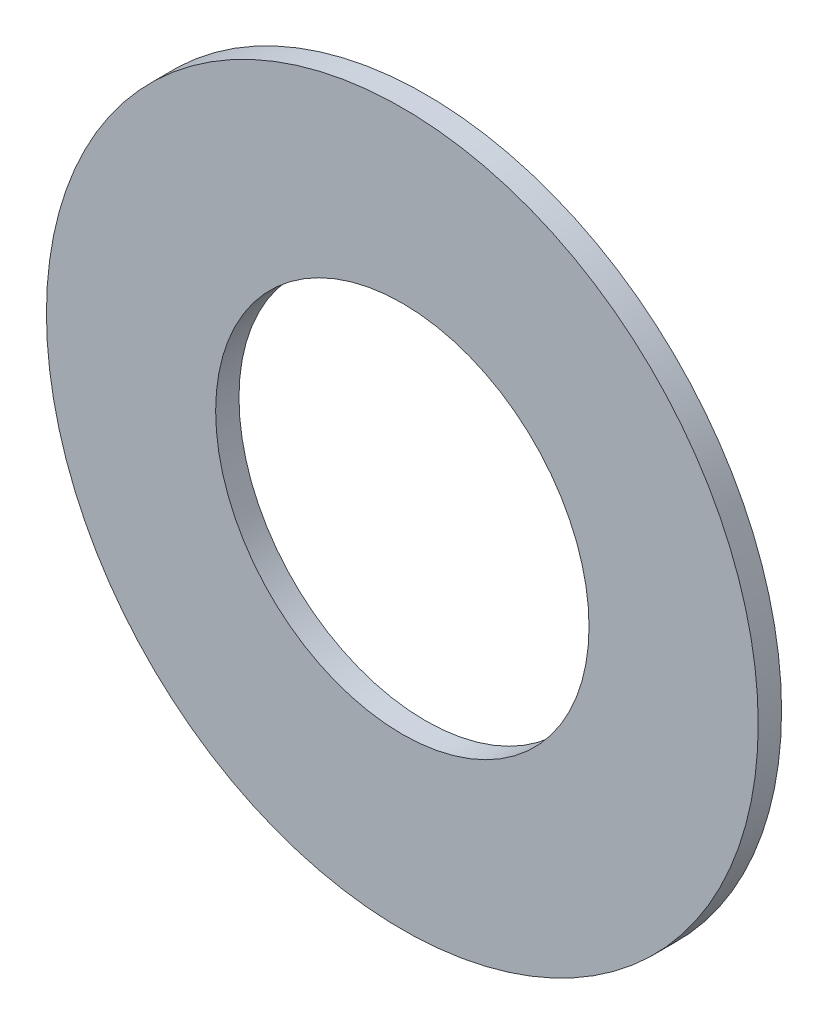
ISO-10303-21;
HEADER;
FILE_DESCRIPTION(('STEP AP214'),'2;1');
FILE_NAME('part.step','',(''),(''),'','','');
FILE_SCHEMA(('AUTOMOTIVE_DESIGN { 1 0 10303 214 1 1 1 1 }'));
ENDSEC;
DATA;
#1=APPLICATION_CONTEXT('core data for automotive mechanical design processes');
#2=APPLICATION_PROTOCOL_DEFINITION('international standard','automotive_design',2000,#1);
#3=PRODUCT_CONTEXT('',#1,'mechanical');
#4=PRODUCT('Part','Part','',(#3));
#5=PRODUCT_RELATED_PRODUCT_CATEGORY('part','',(#4));
#6=PRODUCT_DEFINITION_FORMATION('','',#4);
#7=PRODUCT_DEFINITION_CONTEXT('part definition',#1,'design');
#8=PRODUCT_DEFINITION('design','',#6,#7);
#9=PRODUCT_DEFINITION_SHAPE('','',#8);
#10=(LENGTH_UNIT() NAMED_UNIT(*) SI_UNIT(.MILLI.,.METRE.));
#11=(NAMED_UNIT(*) PLANE_ANGLE_UNIT() SI_UNIT($,.RADIAN.));
#12=(NAMED_UNIT(*) SI_UNIT($,.STERADIAN.) SOLID_ANGLE_UNIT());
#13=UNCERTAINTY_MEASURE_WITH_UNIT(LENGTH_MEASURE(1.E-05),#10,'distance_accuracy_value','');
#14=(GEOMETRIC_REPRESENTATION_CONTEXT(3) GLOBAL_UNCERTAINTY_ASSIGNED_CONTEXT((#13)) GLOBAL_UNIT_ASSIGNED_CONTEXT((#10,
#11,#12)) REPRESENTATION_CONTEXT('',''));
#15=CARTESIAN_POINT('',(0.,0.,0.));
#16=DIRECTION('',(0.,0.,1.));
#17=DIRECTION('',(1.,0.,0.));
#18=AXIS2_PLACEMENT_3D('',#15,#16,#17);
#19=CARTESIAN_POINT('',(0.,0.,1.00000000000008));
#20=DIRECTION('',(0.,0.,1.));
#21=DIRECTION('',(1.,0.,0.));
#22=AXIS2_PLACEMENT_3D('',#19,#20,#21);
#23=PLANE('',#22);
#24=CARTESIAN_POINT('',(0.,0.,1.00000000000008));
#25=DIRECTION('',(0.,0.,1.));
#26=DIRECTION('',(1.,0.,0.));
#27=AXIS2_PLACEMENT_3D('',#24,#25,#26);
#28=CIRCLE('',#27,15.25);
#29=CARTESIAN_POINT('',(15.25,0.,1.00000000000007));
#30=VERTEX_POINT('',#29);
#31=EDGE_CURVE('E10',#30,#30,#28,.T.);
#32=ORIENTED_EDGE('',*,*,#31,.T.);
#33=EDGE_LOOP('',(#32));
#34=FACE_BOUND('',#33,.T.);
#35=CARTESIAN_POINT('',(0.,0.,1.00000000000008));
#36=DIRECTION('',(0.,0.,1.));
#37=DIRECTION('',(1.,0.,0.));
#38=AXIS2_PLACEMENT_3D('',#35,#36,#37);
#39=CIRCLE('',#38,8.);
#40=CARTESIAN_POINT('',(8.00000000000001,0.,1.00000000000008));
#41=VERTEX_POINT('',#40);
#42=EDGE_CURVE('E52',#41,#41,#39,.T.);
#43=ORIENTED_EDGE('',*,*,#42,.F.);
#44=EDGE_LOOP('',(#43));
#45=FACE_BOUND('',#44,.T.);
#46=ADVANCED_FACE('F38',(#34,#45),#23,.T.);
#47=CARTESIAN_POINT('',(0.,0.,0.));
#48=DIRECTION('',(0.,0.,1.));
#49=DIRECTION('',(1.,0.,0.));
#50=AXIS2_PLACEMENT_3D('',#47,#48,#49);
#51=PLANE('',#50);
#52=CARTESIAN_POINT('',(0.,0.,0.));
#53=DIRECTION('',(0.,0.,1.));
#54=DIRECTION('',(1.,0.,0.));
#55=AXIS2_PLACEMENT_3D('',#52,#53,#54);
#56=CIRCLE('',#55,15.25);
#57=CARTESIAN_POINT('',(15.2500000000001,0.,0.));
#58=VERTEX_POINT('',#57);
#59=EDGE_CURVE('E46',#58,#58,#56,.T.);
#60=ORIENTED_EDGE('',*,*,#59,.F.);
#61=EDGE_LOOP('',(#60));
#62=FACE_BOUND('',#61,.T.);
#63=CARTESIAN_POINT('',(0.,0.,0.));
#64=DIRECTION('',(0.,0.,1.));
#65=DIRECTION('',(1.,0.,0.));
#66=AXIS2_PLACEMENT_3D('',#63,#64,#65);
#67=CIRCLE('',#66,8.);
#68=CARTESIAN_POINT('',(8.00000000000009,0.,0.));
#69=VERTEX_POINT('',#68);
#70=EDGE_CURVE('E58',#69,#69,#67,.T.);
#71=ORIENTED_EDGE('',*,*,#70,.T.);
#72=EDGE_LOOP('',(#71));
#73=FACE_BOUND('',#72,.T.);
#74=ADVANCED_FACE('F66',(#62,#73),#51,.F.);
#75=CARTESIAN_POINT('',(0.,0.,1.00000000000008));
#76=DIRECTION('',(0.,0.,-1.));
#77=DIRECTION('',(-1.,0.,0.));
#78=AXIS2_PLACEMENT_3D('',#75,#76,#77);
#79=CYLINDRICAL_SURFACE('',#78,15.25);
#80=ORIENTED_EDGE('',*,*,#31,.F.);
#81=EDGE_LOOP('',(#80));
#82=FACE_BOUND('',#81,.T.);
#83=ORIENTED_EDGE('',*,*,#59,.T.);
#84=EDGE_LOOP('',(#83));
#85=FACE_BOUND('',#84,.T.);
#86=ADVANCED_FACE('F40',(#82,#85),#79,.T.);
#87=CARTESIAN_POINT('',(0.,0.,1.00000000000008));
#88=DIRECTION('',(0.,0.,-1.));
#89=DIRECTION('',(-1.,0.,0.));
#90=AXIS2_PLACEMENT_3D('',#87,#88,#89);
#91=CYLINDRICAL_SURFACE('',#90,8.);
#92=ORIENTED_EDGE('',*,*,#42,.T.);
#93=EDGE_LOOP('',(#92));
#94=FACE_BOUND('',#93,.T.);
#95=ORIENTED_EDGE('',*,*,#70,.F.);
#96=EDGE_LOOP('',(#95));
#97=FACE_BOUND('',#96,.T.);
#98=ADVANCED_FACE('F68',(#94,#97),#91,.F.);
#99=CLOSED_SHELL('',(#46,#74,#86,#98));
#100=MANIFOLD_SOLID_BREP('B2',#99);
#101=ADVANCED_BREP_SHAPE_REPRESENTATION('',(#18,#100),#14);
#102=SHAPE_DEFINITION_REPRESENTATION(#9,#101);
ENDSEC;
END-ISO-10303-21;
